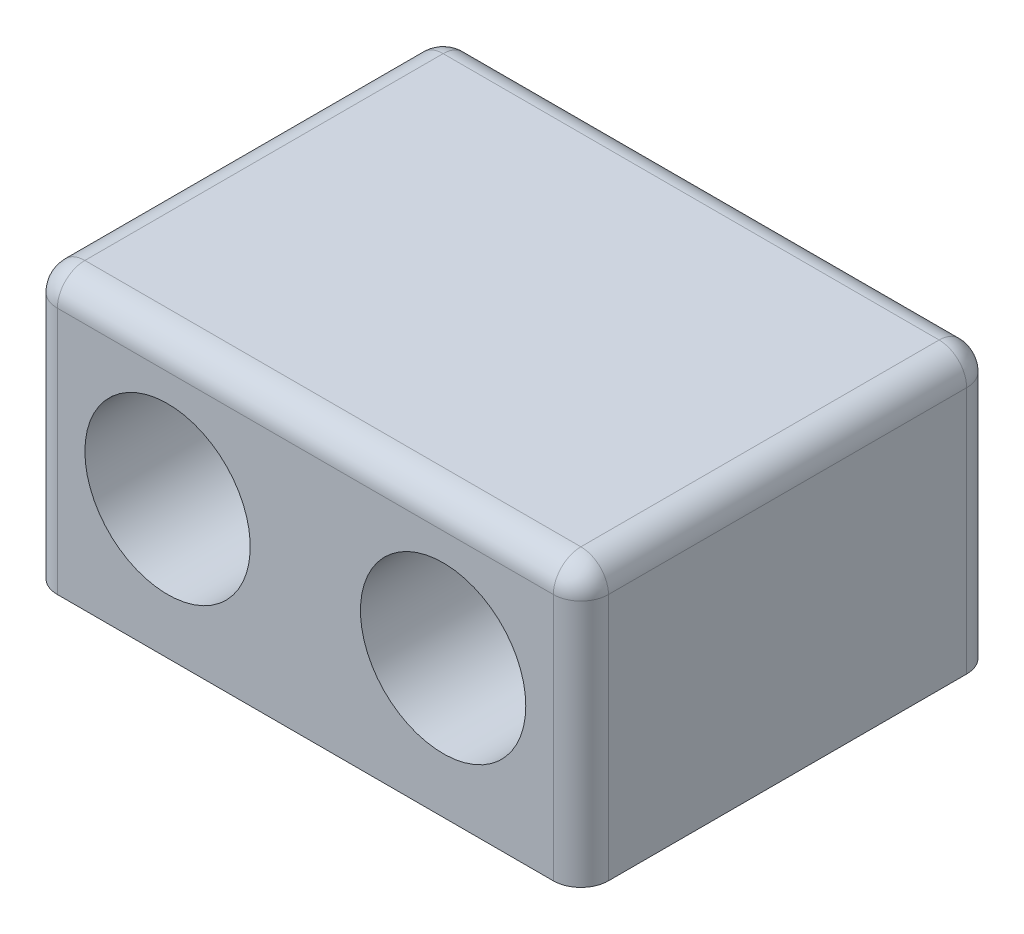
ISO-10303-21;
HEADER;
FILE_DESCRIPTION(('STEP AP214'),'2;1');
FILE_NAME('part.step','',(''),(''),'','','');
FILE_SCHEMA(('AUTOMOTIVE_DESIGN { 1 0 10303 214 1 1 1 1 }'));
ENDSEC;
DATA;
#1=APPLICATION_CONTEXT('core data for automotive mechanical design processes');
#2=APPLICATION_PROTOCOL_DEFINITION('international standard','automotive_design',2000,#1);
#3=PRODUCT_CONTEXT('',#1,'mechanical');
#4=PRODUCT('Part','Part','',(#3));
#5=PRODUCT_RELATED_PRODUCT_CATEGORY('part','',(#4));
#6=PRODUCT_DEFINITION_FORMATION('','',#4);
#7=PRODUCT_DEFINITION_CONTEXT('part definition',#1,'design');
#8=PRODUCT_DEFINITION('design','',#6,#7);
#9=PRODUCT_DEFINITION_SHAPE('','',#8);
#10=(LENGTH_UNIT() NAMED_UNIT(*) SI_UNIT(.MILLI.,.METRE.));
#11=(NAMED_UNIT(*) PLANE_ANGLE_UNIT() SI_UNIT($,.RADIAN.));
#12=(NAMED_UNIT(*) SI_UNIT($,.STERADIAN.) SOLID_ANGLE_UNIT());
#13=UNCERTAINTY_MEASURE_WITH_UNIT(LENGTH_MEASURE(1.E-05),#10,'distance_accuracy_value','');
#14=(GEOMETRIC_REPRESENTATION_CONTEXT(3) GLOBAL_UNCERTAINTY_ASSIGNED_CONTEXT((#13)) GLOBAL_UNIT_ASSIGNED_CONTEXT((#10,
#11,#12)) REPRESENTATION_CONTEXT('',''));
#15=CARTESIAN_POINT('',(0.,0.,0.));
#16=DIRECTION('',(0.,0.,1.));
#17=DIRECTION('',(1.,0.,0.));
#18=AXIS2_PLACEMENT_3D('',#15,#16,#17);
#19=CARTESIAN_POINT('',(-5.,5.,-0.500000000000002));
#20=DIRECTION('',(0.,0.,1.));
#21=DIRECTION('',(-1.,0.,0.));
#22=AXIS2_PLACEMENT_3D('',#19,#20,#21);
#23=PLANE('',#22);
#24=CARTESIAN_POINT('',(-5.,5.,-0.500000000000002));
#25=DIRECTION('',(0.,0.,-1.));
#26=DIRECTION('',(-1.,0.,0.));
#27=AXIS2_PLACEMENT_3D('',#24,#25,#26);
#28=CIRCLE('',#27,3.);
#29=CARTESIAN_POINT('',(-8.,5.,-0.500000000000002));
#30=VERTEX_POINT('',#29);
#31=EDGE_CURVE('E203',#30,#30,#28,.T.);
#32=ORIENTED_EDGE('',*,*,#31,.F.);
#33=EDGE_LOOP('',(#32));
#34=FACE_BOUND('',#33,.T.);
#35=DIRECTION('',(1.,0.,0.));
#36=VECTOR('',#35,1.);
#37=CARTESIAN_POINT('',(-3.75,5.75,-0.500000000000002));
#38=LINE('',#37,#36);
#39=CARTESIAN_POINT('',(-6.25,5.75,-0.500000000000002));
#40=VERTEX_POINT('',#39);
#41=CARTESIAN_POINT('',(-3.75,5.75,-0.500000000000002));
#42=VERTEX_POINT('',#41);
#43=EDGE_CURVE('E192',#40,#42,#38,.T.);
#44=ORIENTED_EDGE('',*,*,#43,.T.);
#45=CARTESIAN_POINT('',(-3.75,5.,-0.500000000000002));
#46=DIRECTION('',(0.,0.,-1.));
#47=DIRECTION('',(-1.,0.,0.));
#48=AXIS2_PLACEMENT_3D('',#45,#46,#47);
#49=CIRCLE('',#48,0.75);
#50=CARTESIAN_POINT('',(-3.75,4.25,-0.500000000000002));
#51=VERTEX_POINT('',#50);
#52=EDGE_CURVE('E177',#42,#51,#49,.T.);
#53=ORIENTED_EDGE('',*,*,#52,.T.);
#54=DIRECTION('',(-1.,0.,0.));
#55=VECTOR('',#54,1.);
#56=CARTESIAN_POINT('',(-3.75,4.25,-0.500000000000002));
#57=LINE('',#56,#55);
#58=CARTESIAN_POINT('',(-6.25,4.25,-0.500000000000002));
#59=VERTEX_POINT('',#58);
#60=EDGE_CURVE('E183',#51,#59,#57,.T.);
#61=ORIENTED_EDGE('',*,*,#60,.T.);
#62=CARTESIAN_POINT('',(-6.25,5.,-0.500000000000002));
#63=DIRECTION('',(0.,0.,-1.));
#64=DIRECTION('',(-1.,0.,0.));
#65=AXIS2_PLACEMENT_3D('',#62,#63,#64);
#66=CIRCLE('',#65,0.75);
#67=EDGE_CURVE('E186',#59,#40,#66,.T.);
#68=ORIENTED_EDGE('',*,*,#67,.T.);
#69=EDGE_LOOP('',(#44,#53,#61,#68));
#70=FACE_BOUND('',#69,.T.);
#71=ADVANCED_FACE('F33',(#34,#70),#23,.T.);
#72=CARTESIAN_POINT('',(-10.,10.,-7.5));
#73=DIRECTION('',(0.,0.,1.));
#74=DIRECTION('',(1.,0.,0.));
#75=AXIS2_PLACEMENT_3D('',#72,#73,#74);
#76=PLANE('',#75);
#77=DIRECTION('',(-1.,0.,0.));
#78=VECTOR('',#77,1.);
#79=CARTESIAN_POINT('',(-10.,9.,-7.5));
#80=LINE('',#79,#78);
#81=CARTESIAN_POINT('',(-9.,9.,-7.5));
#82=VERTEX_POINT('',#81);
#83=CARTESIAN_POINT('',(9.,9.,-7.5));
#84=VERTEX_POINT('',#83);
#85=EDGE_CURVE('E281',#82,#84,#80,.F.);
#86=ORIENTED_EDGE('',*,*,#85,.T.);
#87=DIRECTION('',(0.,-1.,0.));
#88=VECTOR('',#87,1.);
#89=CARTESIAN_POINT('',(9.,10.,-7.5));
#90=LINE('',#89,#88);
#91=CARTESIAN_POINT('',(9.,0.,-7.5));
#92=VERTEX_POINT('',#91);
#93=EDGE_CURVE('E283',#84,#92,#90,.T.);
#94=ORIENTED_EDGE('',*,*,#93,.T.);
#95=DIRECTION('',(-1.,0.,0.));
#96=VECTOR('',#95,1.);
#97=CARTESIAN_POINT('',(-10.,0.,-7.5));
#98=LINE('',#97,#96);
#99=CARTESIAN_POINT('',(-9.,0.,-7.5));
#100=VERTEX_POINT('',#99);
#101=EDGE_CURVE('E248',#92,#100,#98,.T.);
#102=ORIENTED_EDGE('',*,*,#101,.T.);
#103=DIRECTION('',(0.,-1.,0.));
#104=VECTOR('',#103,1.);
#105=CARTESIAN_POINT('',(-9.,10.,-7.5));
#106=LINE('',#105,#104);
#107=EDGE_CURVE('E279',#100,#82,#106,.F.);
#108=ORIENTED_EDGE('',*,*,#107,.T.);
#109=EDGE_LOOP('',(#86,#94,#102,#108));
#110=FACE_BOUND('',#109,.T.);
#111=DIRECTION('',(-1.,0.,0.));
#112=VECTOR('',#111,1.);
#113=CARTESIAN_POINT('',(3.75,5.75,-7.5));
#114=LINE('',#113,#112);
#115=CARTESIAN_POINT('',(6.25,5.75,-7.5));
#116=VERTEX_POINT('',#115);
#117=CARTESIAN_POINT('',(3.75,5.75,-7.5));
#118=VERTEX_POINT('',#117);
#119=EDGE_CURVE('E219',#116,#118,#114,.T.);
#120=ORIENTED_EDGE('',*,*,#119,.T.);
#121=CARTESIAN_POINT('',(3.75,5.,-7.5));
#122=DIRECTION('',(0.,0.,1.));
#123=DIRECTION('',(1.,0.,0.));
#124=AXIS2_PLACEMENT_3D('',#121,#122,#123);
#125=CIRCLE('',#124,0.75);
#126=CARTESIAN_POINT('',(3.75,4.25,-7.5));
#127=VERTEX_POINT('',#126);
#128=EDGE_CURVE('E209',#118,#127,#125,.T.);
#129=ORIENTED_EDGE('',*,*,#128,.T.);
#130=DIRECTION('',(1.,0.,0.));
#131=VECTOR('',#130,1.);
#132=CARTESIAN_POINT('',(3.75,4.25,-7.5));
#133=LINE('',#132,#131);
#134=CARTESIAN_POINT('',(6.25,4.25,-7.5));
#135=VERTEX_POINT('',#134);
#136=EDGE_CURVE('E212',#127,#135,#133,.T.);
#137=ORIENTED_EDGE('',*,*,#136,.T.);
#138=CARTESIAN_POINT('',(6.25,5.,-7.5));
#139=DIRECTION('',(0.,0.,1.));
#140=DIRECTION('',(1.,0.,0.));
#141=AXIS2_PLACEMENT_3D('',#138,#139,#140);
#142=CIRCLE('',#141,0.75);
#143=EDGE_CURVE('E216',#135,#116,#142,.T.);
#144=ORIENTED_EDGE('',*,*,#143,.T.);
#145=EDGE_LOOP('',(#120,#129,#137,#144));
#146=FACE_BOUND('',#145,.T.);
#147=CARTESIAN_POINT('',(-3.75,5.,-7.5));
#148=DIRECTION('',(0.,0.,-1.));
#149=DIRECTION('',(-1.,0.,0.));
#150=AXIS2_PLACEMENT_3D('',#147,#148,#149);
#151=CIRCLE('',#150,0.75);
#152=CARTESIAN_POINT('',(-3.75,5.75,-7.5));
#153=VERTEX_POINT('',#152);
#154=CARTESIAN_POINT('',(-3.75,4.25,-7.5));
#155=VERTEX_POINT('',#154);
#156=EDGE_CURVE('E170',#153,#155,#151,.T.);
#157=ORIENTED_EDGE('',*,*,#156,.F.);
#158=DIRECTION('',(1.,0.,0.));
#159=VECTOR('',#158,1.);
#160=CARTESIAN_POINT('',(-3.75,5.75,-7.5));
#161=LINE('',#160,#159);
#162=CARTESIAN_POINT('',(-6.25,5.75,-7.5));
#163=VERTEX_POINT('',#162);
#164=EDGE_CURVE('E158',#163,#153,#161,.T.);
#165=ORIENTED_EDGE('',*,*,#164,.F.);
#166=CARTESIAN_POINT('',(-6.25,5.,-7.5));
#167=DIRECTION('',(0.,0.,-1.));
#168=DIRECTION('',(-1.,0.,0.));
#169=AXIS2_PLACEMENT_3D('',#166,#167,#168);
#170=CIRCLE('',#169,0.75);
#171=CARTESIAN_POINT('',(-6.25,4.25,-7.5));
#172=VERTEX_POINT('',#171);
#173=EDGE_CURVE('E169',#172,#163,#170,.T.);
#174=ORIENTED_EDGE('',*,*,#173,.F.);
#175=DIRECTION('',(-1.,0.,0.));
#176=VECTOR('',#175,1.);
#177=CARTESIAN_POINT('',(-3.75,4.25,-7.5));
#178=LINE('',#177,#176);
#179=EDGE_CURVE('E179',#155,#172,#178,.T.);
#180=ORIENTED_EDGE('',*,*,#179,.F.);
#181=EDGE_LOOP('',(#157,#165,#174,#180));
#182=FACE_BOUND('',#181,.T.);
#183=ADVANCED_FACE('F182',(#110,#146,#182),#76,.F.);
#184=CARTESIAN_POINT('',(10.,10.,7.5));
#185=DIRECTION('',(-1.,0.,0.));
#186=DIRECTION('',(0.,0.,1.));
#187=AXIS2_PLACEMENT_3D('',#184,#185,#186);
#188=PLANE('',#187);
#189=DIRECTION('',(0.,0.,-1.));
#190=VECTOR('',#189,1.);
#191=CARTESIAN_POINT('',(10.,0.,7.5));
#192=LINE('',#191,#190);
#193=CARTESIAN_POINT('',(10.,0.,6.5));
#194=VERTEX_POINT('',#193);
#195=CARTESIAN_POINT('',(10.,0.,-6.5));
#196=VERTEX_POINT('',#195);
#197=EDGE_CURVE('E244',#194,#196,#192,.T.);
#198=ORIENTED_EDGE('',*,*,#197,.T.);
#199=DIRECTION('',(0.,-1.,0.));
#200=VECTOR('',#199,1.);
#201=CARTESIAN_POINT('',(10.,10.,-6.5));
#202=LINE('',#201,#200);
#203=CARTESIAN_POINT('',(10.,9.,-6.5));
#204=VERTEX_POINT('',#203);
#205=EDGE_CURVE('E50',#196,#204,#202,.F.);
#206=ORIENTED_EDGE('',*,*,#205,.T.);
#207=DIRECTION('',(0.,0.,-1.));
#208=VECTOR('',#207,1.);
#209=CARTESIAN_POINT('',(10.,9.,7.5));
#210=LINE('',#209,#208);
#211=CARTESIAN_POINT('',(10.,9.,6.5));
#212=VERTEX_POINT('',#211);
#213=EDGE_CURVE('E55',#204,#212,#210,.F.);
#214=ORIENTED_EDGE('',*,*,#213,.T.);
#215=DIRECTION('',(0.,-1.,0.));
#216=VECTOR('',#215,1.);
#217=CARTESIAN_POINT('',(10.,10.,6.5));
#218=LINE('',#217,#216);
#219=EDGE_CURVE('E285',#212,#194,#218,.T.);
#220=ORIENTED_EDGE('',*,*,#219,.T.);
#221=EDGE_LOOP('',(#198,#206,#214,#220));
#222=FACE_BOUND('',#221,.T.);
#223=ADVANCED_FACE('F360',(#222),#188,.F.);
#224=CARTESIAN_POINT('',(-10.,10.,7.5));
#225=DIRECTION('',(1.,0.,0.));
#226=DIRECTION('',(0.,0.,-1.));
#227=AXIS2_PLACEMENT_3D('',#224,#225,#226);
#228=PLANE('',#227);
#229=DIRECTION('',(0.,0.,1.));
#230=VECTOR('',#229,1.);
#231=CARTESIAN_POINT('',(-10.,9.,7.5));
#232=LINE('',#231,#230);
#233=CARTESIAN_POINT('',(-10.,9.,6.5));
#234=VERTEX_POINT('',#233);
#235=CARTESIAN_POINT('',(-10.,9.,-6.5));
#236=VERTEX_POINT('',#235);
#237=EDGE_CURVE('E275',#234,#236,#232,.F.);
#238=ORIENTED_EDGE('',*,*,#237,.T.);
#239=DIRECTION('',(0.,-1.,0.));
#240=VECTOR('',#239,1.);
#241=CARTESIAN_POINT('',(-10.,10.,-6.5));
#242=LINE('',#241,#240);
#243=CARTESIAN_POINT('',(-10.,0.,-6.5));
#244=VERTEX_POINT('',#243);
#245=EDGE_CURVE('E277',#236,#244,#242,.T.);
#246=ORIENTED_EDGE('',*,*,#245,.T.);
#247=DIRECTION('',(0.,0.,1.));
#248=VECTOR('',#247,1.);
#249=CARTESIAN_POINT('',(-10.,0.,7.5));
#250=LINE('',#249,#248);
#251=CARTESIAN_POINT('',(-10.,0.,6.5));
#252=VERTEX_POINT('',#251);
#253=EDGE_CURVE('E251',#244,#252,#250,.T.);
#254=ORIENTED_EDGE('',*,*,#253,.T.);
#255=DIRECTION('',(0.,-1.,0.));
#256=VECTOR('',#255,1.);
#257=CARTESIAN_POINT('',(-10.,10.,6.5));
#258=LINE('',#257,#256);
#259=EDGE_CURVE('E273',#252,#234,#258,.F.);
#260=ORIENTED_EDGE('',*,*,#259,.T.);
#261=EDGE_LOOP('',(#238,#246,#254,#260));
#262=FACE_BOUND('',#261,.T.);
#263=ADVANCED_FACE('F384',(#262),#228,.F.);
#264=CARTESIAN_POINT('',(-10.,10.,7.5));
#265=DIRECTION('',(0.,0.,-1.));
#266=DIRECTION('',(-1.,0.,0.));
#267=AXIS2_PLACEMENT_3D('',#264,#265,#266);
#268=PLANE('',#267);
#269=CARTESIAN_POINT('',(-5.,5.,7.5));
#270=DIRECTION('',(0.,0.,-1.));
#271=DIRECTION('',(-1.,0.,0.));
#272=AXIS2_PLACEMENT_3D('',#269,#270,#271);
#273=CIRCLE('',#272,3.);
#274=CARTESIAN_POINT('',(-8.,5.,7.5));
#275=VERTEX_POINT('',#274);
#276=EDGE_CURVE('E198',#275,#275,#273,.T.);
#277=ORIENTED_EDGE('',*,*,#276,.T.);
#278=EDGE_LOOP('',(#277));
#279=FACE_BOUND('',#278,.T.);
#280=CARTESIAN_POINT('',(5.,5.,7.5));
#281=DIRECTION('',(0.,0.,1.));
#282=DIRECTION('',(1.,0.,0.));
#283=AXIS2_PLACEMENT_3D('',#280,#281,#282);
#284=CIRCLE('',#283,3.);
#285=CARTESIAN_POINT('',(8.,5.,7.5));
#286=VERTEX_POINT('',#285);
#287=EDGE_CURVE('E234',#286,#286,#284,.T.);
#288=ORIENTED_EDGE('',*,*,#287,.F.);
#289=EDGE_LOOP('',(#288));
#290=FACE_BOUND('',#289,.T.);
#291=DIRECTION('',(1.,0.,0.));
#292=VECTOR('',#291,1.);
#293=CARTESIAN_POINT('',(-10.,0.,7.5));
#294=LINE('',#293,#292);
#295=CARTESIAN_POINT('',(-9.,0.,7.5));
#296=VERTEX_POINT('',#295);
#297=CARTESIAN_POINT('',(9.,0.,7.5));
#298=VERTEX_POINT('',#297);
#299=EDGE_CURVE('E254',#296,#298,#294,.T.);
#300=ORIENTED_EDGE('',*,*,#299,.T.);
#301=DIRECTION('',(0.,-1.,0.));
#302=VECTOR('',#301,1.);
#303=CARTESIAN_POINT('',(9.,10.,7.5));
#304=LINE('',#303,#302);
#305=CARTESIAN_POINT('',(9.,9.,7.5));
#306=VERTEX_POINT('',#305);
#307=EDGE_CURVE('E271',#298,#306,#304,.F.);
#308=ORIENTED_EDGE('',*,*,#307,.T.);
#309=DIRECTION('',(1.,0.,0.));
#310=VECTOR('',#309,1.);
#311=CARTESIAN_POINT('',(-10.,9.,7.5));
#312=LINE('',#311,#310);
#313=CARTESIAN_POINT('',(-9.,9.,7.5));
#314=VERTEX_POINT('',#313);
#315=EDGE_CURVE('E268',#306,#314,#312,.F.);
#316=ORIENTED_EDGE('',*,*,#315,.T.);
#317=DIRECTION('',(0.,-1.,0.));
#318=VECTOR('',#317,1.);
#319=CARTESIAN_POINT('',(-9.,10.,7.5));
#320=LINE('',#319,#318);
#321=EDGE_CURVE('E266',#314,#296,#320,.T.);
#322=ORIENTED_EDGE('',*,*,#321,.T.);
#323=EDGE_LOOP('',(#300,#308,#316,#322));
#324=FACE_BOUND('',#323,.T.);
#325=ADVANCED_FACE('F375',(#279,#290,#324),#268,.F.);
#326=CARTESIAN_POINT('',(0.,10.,0.));
#327=DIRECTION('',(0.,-1.,0.));
#328=DIRECTION('',(0.,0.,-1.));
#329=AXIS2_PLACEMENT_3D('',#326,#327,#328);
#330=PLANE('',#329);
#331=DIRECTION('',(0.,0.,1.));
#332=VECTOR('',#331,1.);
#333=CARTESIAN_POINT('',(-9.,10.,0.));
#334=LINE('',#333,#332);
#335=CARTESIAN_POINT('',(-9.,10.,-6.5));
#336=VERTEX_POINT('',#335);
#337=CARTESIAN_POINT('',(-9.,10.,6.5));
#338=VERTEX_POINT('',#337);
#339=EDGE_CURVE('E261',#336,#338,#334,.T.);
#340=ORIENTED_EDGE('',*,*,#339,.T.);
#341=DIRECTION('',(1.,0.,0.));
#342=VECTOR('',#341,1.);
#343=CARTESIAN_POINT('',(0.,10.,6.5));
#344=LINE('',#343,#342);
#345=CARTESIAN_POINT('',(9.,10.,6.5));
#346=VERTEX_POINT('',#345);
#347=EDGE_CURVE('E263',#338,#346,#344,.T.);
#348=ORIENTED_EDGE('',*,*,#347,.T.);
#349=DIRECTION('',(0.,0.,-1.));
#350=VECTOR('',#349,1.);
#351=CARTESIAN_POINT('',(9.,10.,0.));
#352=LINE('',#351,#350);
#353=CARTESIAN_POINT('',(9.,10.,-6.5));
#354=VERTEX_POINT('',#353);
#355=EDGE_CURVE('E257',#346,#354,#352,.T.);
#356=ORIENTED_EDGE('',*,*,#355,.T.);
#357=DIRECTION('',(-1.,0.,0.));
#358=VECTOR('',#357,1.);
#359=CARTESIAN_POINT('',(0.,10.,-6.5));
#360=LINE('',#359,#358);
#361=EDGE_CURVE('E259',#354,#336,#360,.T.);
#362=ORIENTED_EDGE('',*,*,#361,.T.);
#363=EDGE_LOOP('',(#340,#348,#356,#362));
#364=FACE_BOUND('',#363,.T.);
#365=ADVANCED_FACE('F340',(#364),#330,.F.);
#366=CARTESIAN_POINT('',(0.,0.,0.));
#367=DIRECTION('',(0.,-1.,0.));
#368=DIRECTION('',(0.,0.,-1.));
#369=AXIS2_PLACEMENT_3D('',#366,#367,#368);
#370=PLANE('',#369);
#371=ORIENTED_EDGE('',*,*,#101,.F.);
#372=CARTESIAN_POINT('',(9.,0.,-6.5));
#373=DIRECTION('',(0.,-1.,0.));
#374=DIRECTION('',(0.,0.,-1.));
#375=AXIS2_PLACEMENT_3D('',#372,#373,#374);
#376=CIRCLE('',#375,1.);
#377=EDGE_CURVE('E11',#92,#196,#376,.T.);
#378=ORIENTED_EDGE('',*,*,#377,.T.);
#379=ORIENTED_EDGE('',*,*,#197,.F.);
#380=CARTESIAN_POINT('',(9.,0.,6.5));
#381=DIRECTION('',(0.,-1.,0.));
#382=DIRECTION('',(0.,0.,-1.));
#383=AXIS2_PLACEMENT_3D('',#380,#381,#382);
#384=CIRCLE('',#383,1.);
#385=EDGE_CURVE('E291',#194,#298,#384,.T.);
#386=ORIENTED_EDGE('',*,*,#385,.T.);
#387=ORIENTED_EDGE('',*,*,#299,.F.);
#388=CARTESIAN_POINT('',(-9.,0.,6.5));
#389=DIRECTION('',(0.,-1.,0.));
#390=DIRECTION('',(0.,0.,-1.));
#391=AXIS2_PLACEMENT_3D('',#388,#389,#390);
#392=CIRCLE('',#391,1.);
#393=EDGE_CURVE('E289',#296,#252,#392,.T.);
#394=ORIENTED_EDGE('',*,*,#393,.T.);
#395=ORIENTED_EDGE('',*,*,#253,.F.);
#396=CARTESIAN_POINT('',(-9.,0.,-6.5));
#397=DIRECTION('',(0.,-1.,0.));
#398=DIRECTION('',(0.,0.,-1.));
#399=AXIS2_PLACEMENT_3D('',#396,#397,#398);
#400=CIRCLE('',#399,1.);
#401=EDGE_CURVE('E42',#244,#100,#400,.T.);
#402=ORIENTED_EDGE('',*,*,#401,.T.);
#403=EDGE_LOOP('',(#371,#378,#379,#386,#387,#394,#395,#402));
#404=FACE_BOUND('',#403,.T.);
#405=ADVANCED_FACE('F358',(#404),#370,.T.);
#406=CARTESIAN_POINT('',(5.,5.,-0.500000000000002));
#407=DIRECTION('',(0.,0.,1.));
#408=DIRECTION('',(1.,0.,0.));
#409=AXIS2_PLACEMENT_3D('',#406,#407,#408);
#410=CYLINDRICAL_SURFACE('',#409,3.);
#411=CARTESIAN_POINT('',(5.,5.,-0.500000000000002));
#412=DIRECTION('',(0.,0.,1.));
#413=DIRECTION('',(1.,0.,0.));
#414=AXIS2_PLACEMENT_3D('',#411,#412,#413);
#415=CIRCLE('',#414,3.);
#416=CARTESIAN_POINT('',(8.,5.,-0.500000000000002));
#417=VERTEX_POINT('',#416);
#418=EDGE_CURVE('E241',#417,#417,#415,.T.);
#419=ORIENTED_EDGE('',*,*,#418,.F.);
#420=EDGE_LOOP('',(#419));
#421=FACE_BOUND('',#420,.T.);
#422=ORIENTED_EDGE('',*,*,#287,.T.);
#423=EDGE_LOOP('',(#422));
#424=FACE_BOUND('',#423,.T.);
#425=ADVANCED_FACE('F427',(#421,#424),#410,.F.);
#426=CARTESIAN_POINT('',(5.,5.,-0.500000000000002));
#427=DIRECTION('',(0.,0.,1.));
#428=DIRECTION('',(1.,0.,0.));
#429=AXIS2_PLACEMENT_3D('',#426,#427,#428);
#430=PLANE('',#429);
#431=CARTESIAN_POINT('',(3.75,5.,-0.500000000000002));
#432=DIRECTION('',(0.,0.,1.));
#433=DIRECTION('',(1.,0.,0.));
#434=AXIS2_PLACEMENT_3D('',#431,#432,#433);
#435=CIRCLE('',#434,0.75);
#436=CARTESIAN_POINT('',(3.75,5.75,-0.500000000000002));
#437=VERTEX_POINT('',#436);
#438=CARTESIAN_POINT('',(3.75,4.25,-0.500000000000002));
#439=VERTEX_POINT('',#438);
#440=EDGE_CURVE('E206',#437,#439,#435,.T.);
#441=ORIENTED_EDGE('',*,*,#440,.F.);
#442=DIRECTION('',(-1.,0.,0.));
#443=VECTOR('',#442,1.);
#444=CARTESIAN_POINT('',(3.75,5.75,-0.500000000000002));
#445=LINE('',#444,#443);
#446=CARTESIAN_POINT('',(6.25,5.75,-0.500000000000002));
#447=VERTEX_POINT('',#446);
#448=EDGE_CURVE('E213',#447,#437,#445,.T.);
#449=ORIENTED_EDGE('',*,*,#448,.F.);
#450=CARTESIAN_POINT('',(6.25,5.,-0.500000000000002));
#451=DIRECTION('',(0.,0.,1.));
#452=DIRECTION('',(1.,0.,0.));
#453=AXIS2_PLACEMENT_3D('',#450,#451,#452);
#454=CIRCLE('',#453,0.75);
#455=CARTESIAN_POINT('',(6.25,4.25,-0.500000000000002));
#456=VERTEX_POINT('',#455);
#457=EDGE_CURVE('E228',#456,#447,#454,.T.);
#458=ORIENTED_EDGE('',*,*,#457,.F.);
#459=DIRECTION('',(1.,0.,0.));
#460=VECTOR('',#459,1.);
#461=CARTESIAN_POINT('',(3.75,4.25,-0.500000000000002));
#462=LINE('',#461,#460);
#463=EDGE_CURVE('E225',#439,#456,#462,.T.);
#464=ORIENTED_EDGE('',*,*,#463,.F.);
#465=EDGE_LOOP('',(#441,#449,#458,#464));
#466=FACE_BOUND('',#465,.T.);
#467=ORIENTED_EDGE('',*,*,#418,.T.);
#468=EDGE_LOOP('',(#467));
#469=FACE_BOUND('',#468,.T.);
#470=ADVANCED_FACE('F423',(#466,#469),#430,.T.);
#471=CARTESIAN_POINT('',(3.75,5.,-7.5));
#472=DIRECTION('',(0.,0.,1.));
#473=DIRECTION('',(1.,0.,0.));
#474=AXIS2_PLACEMENT_3D('',#471,#472,#473);
#475=CYLINDRICAL_SURFACE('',#474,0.75);
#476=ORIENTED_EDGE('',*,*,#440,.T.);
#477=DIRECTION('',(0.,0.,1.));
#478=VECTOR('',#477,1.);
#479=CARTESIAN_POINT('',(3.75,4.25,-7.5));
#480=LINE('',#479,#478);
#481=EDGE_CURVE('E222',#127,#439,#480,.T.);
#482=ORIENTED_EDGE('',*,*,#481,.F.);
#483=ORIENTED_EDGE('',*,*,#128,.F.);
#484=DIRECTION('',(0.,0.,1.));
#485=VECTOR('',#484,1.);
#486=CARTESIAN_POINT('',(3.75,5.75,-7.5));
#487=LINE('',#486,#485);
#488=EDGE_CURVE('E232',#118,#437,#487,.T.);
#489=ORIENTED_EDGE('',*,*,#488,.T.);
#490=EDGE_LOOP('',(#476,#482,#483,#489));
#491=FACE_BOUND('',#490,.T.);
#492=ADVANCED_FACE('F413',(#491),#475,.F.);
#493=CARTESIAN_POINT('',(3.75,5.75,-7.5));
#494=DIRECTION('',(0.,1.,0.));
#495=DIRECTION('',(-1.,0.,0.));
#496=AXIS2_PLACEMENT_3D('',#493,#494,#495);
#497=PLANE('',#496);
#498=ORIENTED_EDGE('',*,*,#448,.T.);
#499=ORIENTED_EDGE('',*,*,#488,.F.);
#500=ORIENTED_EDGE('',*,*,#119,.F.);
#501=DIRECTION('',(0.,0.,1.));
#502=VECTOR('',#501,1.);
#503=CARTESIAN_POINT('',(6.25,5.75,-7.5));
#504=LINE('',#503,#502);
#505=EDGE_CURVE('E235',#116,#447,#504,.T.);
#506=ORIENTED_EDGE('',*,*,#505,.T.);
#507=EDGE_LOOP('',(#498,#499,#500,#506));
#508=FACE_BOUND('',#507,.T.);
#509=ADVANCED_FACE('F409',(#508),#497,.F.);
#510=CARTESIAN_POINT('',(6.25,5.,-7.5));
#511=DIRECTION('',(0.,0.,1.));
#512=DIRECTION('',(1.,0.,0.));
#513=AXIS2_PLACEMENT_3D('',#510,#511,#512);
#514=CYLINDRICAL_SURFACE('',#513,0.75);
#515=ORIENTED_EDGE('',*,*,#457,.T.);
#516=ORIENTED_EDGE('',*,*,#505,.F.);
#517=ORIENTED_EDGE('',*,*,#143,.F.);
#518=DIRECTION('',(0.,0.,1.));
#519=VECTOR('',#518,1.);
#520=CARTESIAN_POINT('',(6.25,4.25,-7.5));
#521=LINE('',#520,#519);
#522=EDGE_CURVE('E238',#135,#456,#521,.T.);
#523=ORIENTED_EDGE('',*,*,#522,.T.);
#524=EDGE_LOOP('',(#515,#516,#517,#523));
#525=FACE_BOUND('',#524,.T.);
#526=ADVANCED_FACE('F412',(#525),#514,.F.);
#527=CARTESIAN_POINT('',(3.75,4.25,-7.5));
#528=DIRECTION('',(0.,-1.,0.));
#529=DIRECTION('',(1.,0.,0.));
#530=AXIS2_PLACEMENT_3D('',#527,#528,#529);
#531=PLANE('',#530);
#532=ORIENTED_EDGE('',*,*,#463,.T.);
#533=ORIENTED_EDGE('',*,*,#522,.F.);
#534=ORIENTED_EDGE('',*,*,#136,.F.);
#535=ORIENTED_EDGE('',*,*,#481,.T.);
#536=EDGE_LOOP('',(#532,#533,#534,#535));
#537=FACE_BOUND('',#536,.T.);
#538=ADVANCED_FACE('F407',(#537),#531,.F.);
#539=CARTESIAN_POINT('',(-5.,5.,-0.500000000000002));
#540=DIRECTION('',(0.,0.,1.));
#541=DIRECTION('',(1.,0.,0.));
#542=AXIS2_PLACEMENT_3D('',#539,#540,#541);
#543=CYLINDRICAL_SURFACE('',#542,3.);
#544=ORIENTED_EDGE('',*,*,#31,.T.);
#545=EDGE_LOOP('',(#544));
#546=FACE_BOUND('',#545,.T.);
#547=ORIENTED_EDGE('',*,*,#276,.F.);
#548=EDGE_LOOP('',(#547));
#549=FACE_BOUND('',#548,.T.);
#550=ADVANCED_FACE('F404',(#546,#549),#543,.F.);
#551=CARTESIAN_POINT('',(-3.75,5.,-7.5));
#552=DIRECTION('',(0.,0.,1.));
#553=DIRECTION('',(1.,0.,0.));
#554=AXIS2_PLACEMENT_3D('',#551,#552,#553);
#555=CYLINDRICAL_SURFACE('',#554,0.75);
#556=ORIENTED_EDGE('',*,*,#52,.F.);
#557=DIRECTION('',(0.,0.,1.));
#558=VECTOR('',#557,1.);
#559=CARTESIAN_POINT('',(-3.75,5.75,-7.5));
#560=LINE('',#559,#558);
#561=EDGE_CURVE('E162',#153,#42,#560,.T.);
#562=ORIENTED_EDGE('',*,*,#561,.F.);
#563=ORIENTED_EDGE('',*,*,#156,.T.);
#564=DIRECTION('',(0.,0.,1.));
#565=VECTOR('',#564,1.);
#566=CARTESIAN_POINT('',(-3.75,4.25,-7.5));
#567=LINE('',#566,#565);
#568=EDGE_CURVE('E196',#155,#51,#567,.T.);
#569=ORIENTED_EDGE('',*,*,#568,.T.);
#570=EDGE_LOOP('',(#556,#562,#563,#569));
#571=FACE_BOUND('',#570,.T.);
#572=ADVANCED_FACE('F173',(#571),#555,.F.);
#573=CARTESIAN_POINT('',(-3.75,4.25,-7.5));
#574=DIRECTION('',(0.,1.,0.));
#575=DIRECTION('',(-1.,0.,0.));
#576=AXIS2_PLACEMENT_3D('',#573,#574,#575);
#577=PLANE('',#576);
#578=ORIENTED_EDGE('',*,*,#60,.F.);
#579=ORIENTED_EDGE('',*,*,#568,.F.);
#580=ORIENTED_EDGE('',*,*,#179,.T.);
#581=DIRECTION('',(0.,0.,1.));
#582=VECTOR('',#581,1.);
#583=CARTESIAN_POINT('',(-6.25,4.25,-7.5));
#584=LINE('',#583,#582);
#585=EDGE_CURVE('E199',#172,#59,#584,.T.);
#586=ORIENTED_EDGE('',*,*,#585,.T.);
#587=EDGE_LOOP('',(#578,#579,#580,#586));
#588=FACE_BOUND('',#587,.T.);
#589=ADVANCED_FACE('F549',(#588),#577,.T.);
#590=CARTESIAN_POINT('',(-6.25,5.,-7.5));
#591=DIRECTION('',(0.,0.,1.));
#592=DIRECTION('',(1.,0.,0.));
#593=AXIS2_PLACEMENT_3D('',#590,#591,#592);
#594=CYLINDRICAL_SURFACE('',#593,0.75);
#595=ORIENTED_EDGE('',*,*,#67,.F.);
#596=ORIENTED_EDGE('',*,*,#585,.F.);
#597=ORIENTED_EDGE('',*,*,#173,.T.);
#598=DIRECTION('',(0.,0.,1.));
#599=VECTOR('',#598,1.);
#600=CARTESIAN_POINT('',(-6.25,5.75,-7.5));
#601=LINE('',#600,#599);
#602=EDGE_CURVE('E164',#163,#40,#601,.T.);
#603=ORIENTED_EDGE('',*,*,#602,.T.);
#604=EDGE_LOOP('',(#595,#596,#597,#603));
#605=FACE_BOUND('',#604,.T.);
#606=ADVANCED_FACE('F391',(#605),#594,.F.);
#607=CARTESIAN_POINT('',(-3.75,5.75,-7.5));
#608=DIRECTION('',(0.,-1.,0.));
#609=DIRECTION('',(1.,0.,0.));
#610=AXIS2_PLACEMENT_3D('',#607,#608,#609);
#611=PLANE('',#610);
#612=ORIENTED_EDGE('',*,*,#43,.F.);
#613=ORIENTED_EDGE('',*,*,#602,.F.);
#614=ORIENTED_EDGE('',*,*,#164,.T.);
#615=ORIENTED_EDGE('',*,*,#561,.T.);
#616=EDGE_LOOP('',(#612,#613,#614,#615));
#617=FACE_BOUND('',#616,.T.);
#618=ADVANCED_FACE('F161',(#617),#611,.T.);
#619=CARTESIAN_POINT('',(-9.,10.,-6.5));
#620=DIRECTION('',(0.,-1.,0.));
#621=DIRECTION('',(0.,0.,-1.));
#622=AXIS2_PLACEMENT_3D('',#619,#620,#621);
#623=CYLINDRICAL_SURFACE('',#622,1.);
#624=ORIENTED_EDGE('',*,*,#401,.F.);
#625=ORIENTED_EDGE('',*,*,#245,.F.);
#626=CARTESIAN_POINT('',(-9.,9.,-6.5));
#627=DIRECTION('',(0.,1.,0.));
#628=DIRECTION('',(0.,0.,1.));
#629=AXIS2_PLACEMENT_3D('',#626,#627,#628);
#630=CIRCLE('',#629,1.);
#631=EDGE_CURVE('E37',#82,#236,#630,.T.);
#632=ORIENTED_EDGE('',*,*,#631,.F.);
#633=ORIENTED_EDGE('',*,*,#107,.F.);
#634=EDGE_LOOP('',(#624,#625,#632,#633));
#635=FACE_BOUND('',#634,.T.);
#636=ADVANCED_FACE('F35',(#635),#623,.T.);
#637=CARTESIAN_POINT('',(0.,9.,-6.5));
#638=DIRECTION('',(-1.,0.,0.));
#639=DIRECTION('',(0.,0.,1.));
#640=AXIS2_PLACEMENT_3D('',#637,#638,#639);
#641=CYLINDRICAL_SURFACE('',#640,1.);
#642=CARTESIAN_POINT('',(9.,9.,-6.5));
#643=DIRECTION('',(1.,0.,0.));
#644=DIRECTION('',(0.,1.,0.));
#645=AXIS2_PLACEMENT_3D('',#642,#643,#644);
#646=CIRCLE('',#645,1.);
#647=EDGE_CURVE('E319',#84,#354,#646,.T.);
#648=ORIENTED_EDGE('',*,*,#647,.F.);
#649=ORIENTED_EDGE('',*,*,#85,.F.);
#650=CARTESIAN_POINT('',(-9.,9.,-6.5));
#651=DIRECTION('',(-1.,0.,0.));
#652=DIRECTION('',(0.,0.,1.));
#653=AXIS2_PLACEMENT_3D('',#650,#651,#652);
#654=CIRCLE('',#653,1.);
#655=EDGE_CURVE('E321',#336,#82,#654,.T.);
#656=ORIENTED_EDGE('',*,*,#655,.F.);
#657=ORIENTED_EDGE('',*,*,#361,.F.);
#658=EDGE_LOOP('',(#648,#649,#656,#657));
#659=FACE_BOUND('',#658,.T.);
#660=ADVANCED_FACE('F347',(#659),#641,.T.);
#661=CARTESIAN_POINT('',(9.,10.,-6.5));
#662=DIRECTION('',(0.,-1.,0.));
#663=DIRECTION('',(0.,0.,-1.));
#664=AXIS2_PLACEMENT_3D('',#661,#662,#663);
#665=CYLINDRICAL_SURFACE('',#664,1.);
#666=ORIENTED_EDGE('',*,*,#377,.F.);
#667=ORIENTED_EDGE('',*,*,#93,.F.);
#668=CARTESIAN_POINT('',(9.,9.,-6.5));
#669=DIRECTION('',(0.,1.,0.));
#670=DIRECTION('',(0.,0.,1.));
#671=AXIS2_PLACEMENT_3D('',#668,#669,#670);
#672=CIRCLE('',#671,1.);
#673=EDGE_CURVE('E316',#204,#84,#672,.T.);
#674=ORIENTED_EDGE('',*,*,#673,.F.);
#675=ORIENTED_EDGE('',*,*,#205,.F.);
#676=EDGE_LOOP('',(#666,#667,#674,#675));
#677=FACE_BOUND('',#676,.T.);
#678=ADVANCED_FACE('F354',(#677),#665,.T.);
#679=CARTESIAN_POINT('',(-9.,9.,-6.5));
#680=DIRECTION('',(0.,0.,1.));
#681=DIRECTION('',(1.,0.,0.));
#682=AXIS2_PLACEMENT_3D('',#679,#680,#681);
#683=SPHERICAL_SURFACE('',#682,1.);
#684=ORIENTED_EDGE('',*,*,#655,.T.);
#685=ORIENTED_EDGE('',*,*,#631,.T.);
#686=CARTESIAN_POINT('',(-9.,9.,-6.5));
#687=DIRECTION('',(0.,0.,-1.));
#688=DIRECTION('',(-1.,0.,0.));
#689=AXIS2_PLACEMENT_3D('',#686,#687,#688);
#690=CIRCLE('',#689,1.);
#691=EDGE_CURVE('E313',#336,#236,#690,.F.);
#692=ORIENTED_EDGE('',*,*,#691,.F.);
#693=EDGE_LOOP('',(#684,#685,#692));
#694=FACE_BOUND('',#693,.T.);
#695=ADVANCED_FACE('F328',(#694),#683,.T.);
#696=CARTESIAN_POINT('',(9.,9.,-6.5));
#697=DIRECTION('',(0.,0.,1.));
#698=DIRECTION('',(1.,0.,0.));
#699=AXIS2_PLACEMENT_3D('',#696,#697,#698);
#700=SPHERICAL_SURFACE('',#699,1.);
#701=ORIENTED_EDGE('',*,*,#673,.T.);
#702=ORIENTED_EDGE('',*,*,#647,.T.);
#703=CARTESIAN_POINT('',(9.,9.,-6.5));
#704=DIRECTION('',(0.,0.,-1.));
#705=DIRECTION('',(-1.,0.,0.));
#706=AXIS2_PLACEMENT_3D('',#703,#704,#705);
#707=CIRCLE('',#706,1.);
#708=EDGE_CURVE('E310',#204,#354,#707,.F.);
#709=ORIENTED_EDGE('',*,*,#708,.F.);
#710=EDGE_LOOP('',(#701,#702,#709));
#711=FACE_BOUND('',#710,.T.);
#712=ADVANCED_FACE('F459',(#711),#700,.T.);
#713=CARTESIAN_POINT('',(-9.,10.,6.5));
#714=DIRECTION('',(0.,-1.,0.));
#715=DIRECTION('',(0.,0.,-1.));
#716=AXIS2_PLACEMENT_3D('',#713,#714,#715);
#717=CYLINDRICAL_SURFACE('',#716,1.);
#718=ORIENTED_EDGE('',*,*,#393,.F.);
#719=ORIENTED_EDGE('',*,*,#321,.F.);
#720=CARTESIAN_POINT('',(-9.,9.,6.5));
#721=DIRECTION('',(0.,1.,0.));
#722=DIRECTION('',(0.,0.,1.));
#723=AXIS2_PLACEMENT_3D('',#720,#721,#722);
#724=CIRCLE('',#723,1.);
#725=EDGE_CURVE('E307',#234,#314,#724,.T.);
#726=ORIENTED_EDGE('',*,*,#725,.F.);
#727=ORIENTED_EDGE('',*,*,#259,.F.);
#728=EDGE_LOOP('',(#718,#719,#726,#727));
#729=FACE_BOUND('',#728,.T.);
#730=ADVANCED_FACE('F382',(#729),#717,.T.);
#731=CARTESIAN_POINT('',(-9.,9.,0.));
#732=DIRECTION('',(0.,0.,1.));
#733=DIRECTION('',(1.,0.,0.));
#734=AXIS2_PLACEMENT_3D('',#731,#732,#733);
#735=CYLINDRICAL_SURFACE('',#734,1.);
#736=ORIENTED_EDGE('',*,*,#691,.T.);
#737=ORIENTED_EDGE('',*,*,#237,.F.);
#738=CARTESIAN_POINT('',(-9.,9.,6.5));
#739=DIRECTION('',(0.,0.,1.));
#740=DIRECTION('',(1.,0.,0.));
#741=AXIS2_PLACEMENT_3D('',#738,#739,#740);
#742=CIRCLE('',#741,1.);
#743=EDGE_CURVE('E304',#338,#234,#742,.T.);
#744=ORIENTED_EDGE('',*,*,#743,.F.);
#745=ORIENTED_EDGE('',*,*,#339,.F.);
#746=EDGE_LOOP('',(#736,#737,#744,#745));
#747=FACE_BOUND('',#746,.T.);
#748=ADVANCED_FACE('F335',(#747),#735,.T.);
#749=CARTESIAN_POINT('',(9.,9.,0.));
#750=DIRECTION('',(0.,0.,-1.));
#751=DIRECTION('',(-1.,0.,0.));
#752=AXIS2_PLACEMENT_3D('',#749,#750,#751);
#753=CYLINDRICAL_SURFACE('',#752,1.);
#754=ORIENTED_EDGE('',*,*,#708,.T.);
#755=ORIENTED_EDGE('',*,*,#355,.F.);
#756=CARTESIAN_POINT('',(9.,9.,6.5));
#757=DIRECTION('',(0.,0.,1.));
#758=DIRECTION('',(1.,0.,0.));
#759=AXIS2_PLACEMENT_3D('',#756,#757,#758);
#760=CIRCLE('',#759,1.);
#761=EDGE_CURVE('E301',#212,#346,#760,.T.);
#762=ORIENTED_EDGE('',*,*,#761,.F.);
#763=ORIENTED_EDGE('',*,*,#213,.F.);
#764=EDGE_LOOP('',(#754,#755,#762,#763));
#765=FACE_BOUND('',#764,.T.);
#766=ADVANCED_FACE('F368',(#765),#753,.T.);
#767=CARTESIAN_POINT('',(9.,10.,6.5));
#768=DIRECTION('',(0.,-1.,0.));
#769=DIRECTION('',(0.,0.,-1.));
#770=AXIS2_PLACEMENT_3D('',#767,#768,#769);
#771=CYLINDRICAL_SURFACE('',#770,1.);
#772=ORIENTED_EDGE('',*,*,#385,.F.);
#773=ORIENTED_EDGE('',*,*,#219,.F.);
#774=CARTESIAN_POINT('',(9.,9.,6.5));
#775=DIRECTION('',(0.,1.,0.));
#776=DIRECTION('',(0.,0.,1.));
#777=AXIS2_PLACEMENT_3D('',#774,#775,#776);
#778=CIRCLE('',#777,1.);
#779=EDGE_CURVE('E298',#306,#212,#778,.T.);
#780=ORIENTED_EDGE('',*,*,#779,.F.);
#781=ORIENTED_EDGE('',*,*,#307,.F.);
#782=EDGE_LOOP('',(#772,#773,#780,#781));
#783=FACE_BOUND('',#782,.T.);
#784=ADVANCED_FACE('F364',(#783),#771,.T.);
#785=CARTESIAN_POINT('',(-9.,9.,6.5));
#786=DIRECTION('',(0.,0.,1.));
#787=DIRECTION('',(1.,0.,0.));
#788=AXIS2_PLACEMENT_3D('',#785,#786,#787);
#789=SPHERICAL_SURFACE('',#788,1.);
#790=ORIENTED_EDGE('',*,*,#743,.T.);
#791=ORIENTED_EDGE('',*,*,#725,.T.);
#792=CARTESIAN_POINT('',(-9.,9.,6.5));
#793=DIRECTION('',(-1.,0.,0.));
#794=DIRECTION('',(0.,0.,1.));
#795=AXIS2_PLACEMENT_3D('',#792,#793,#794);
#796=CIRCLE('',#795,1.);
#797=EDGE_CURVE('E296',#338,#314,#796,.F.);
#798=ORIENTED_EDGE('',*,*,#797,.F.);
#799=EDGE_LOOP('',(#790,#791,#798));
#800=FACE_BOUND('',#799,.T.);
#801=ADVANCED_FACE('F447',(#800),#789,.T.);
#802=CARTESIAN_POINT('',(9.,9.,6.5));
#803=DIRECTION('',(0.,0.,1.));
#804=DIRECTION('',(1.,0.,0.));
#805=AXIS2_PLACEMENT_3D('',#802,#803,#804);
#806=SPHERICAL_SURFACE('',#805,1.);
#807=ORIENTED_EDGE('',*,*,#779,.T.);
#808=ORIENTED_EDGE('',*,*,#761,.T.);
#809=CARTESIAN_POINT('',(9.,9.,6.5));
#810=DIRECTION('',(1.,0.,0.));
#811=DIRECTION('',(0.,0.,-1.));
#812=AXIS2_PLACEMENT_3D('',#809,#810,#811);
#813=CIRCLE('',#812,1.);
#814=EDGE_CURVE('E294',#306,#346,#813,.F.);
#815=ORIENTED_EDGE('',*,*,#814,.F.);
#816=EDGE_LOOP('',(#807,#808,#815));
#817=FACE_BOUND('',#816,.T.);
#818=ADVANCED_FACE('F371',(#817),#806,.T.);
#819=CARTESIAN_POINT('',(0.,9.,6.5));
#820=DIRECTION('',(1.,0.,0.));
#821=DIRECTION('',(0.,0.,-1.));
#822=AXIS2_PLACEMENT_3D('',#819,#820,#821);
#823=CYLINDRICAL_SURFACE('',#822,1.);
#824=ORIENTED_EDGE('',*,*,#797,.T.);
#825=ORIENTED_EDGE('',*,*,#315,.F.);
#826=ORIENTED_EDGE('',*,*,#814,.T.);
#827=ORIENTED_EDGE('',*,*,#347,.F.);
#828=EDGE_LOOP('',(#824,#825,#826,#827));
#829=FACE_BOUND('',#828,.T.);
#830=ADVANCED_FACE('F373',(#829),#823,.T.);
#831=CLOSED_SHELL('',(#71,#183,#223,#263,#325,#365,#405,#425,#470,#492,#509,#526,#538,#550,#572,
#589,#606,#618,#636,#660,#678,#695,#712,#730,#748,#766,#784,#801,#818,#830));
#832=MANIFOLD_SOLID_BREP('B2',#831);
#833=ADVANCED_BREP_SHAPE_REPRESENTATION('',(#18,#832),#14);
#834=SHAPE_DEFINITION_REPRESENTATION(#9,#833);
ENDSEC;
END-ISO-10303-21;
